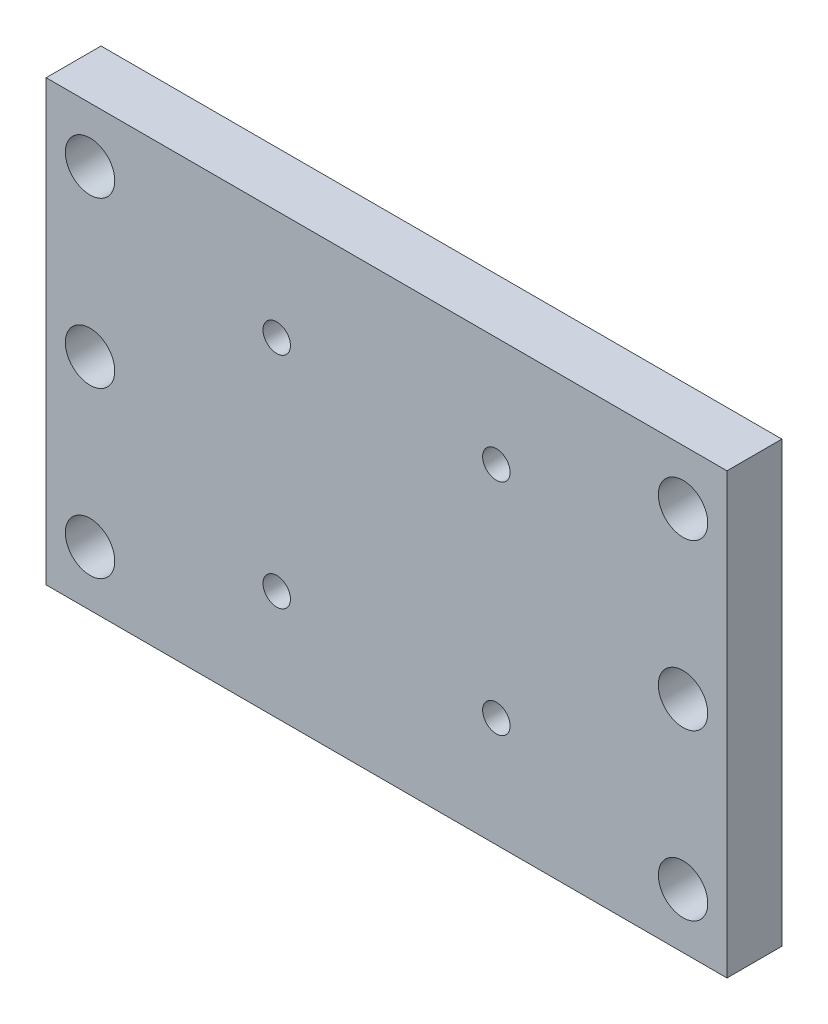
ISO-10303-21;
HEADER;
FILE_DESCRIPTION(('STEP AP214'),'2;1');
FILE_NAME('part.step','',(''),(''),'','','');
FILE_SCHEMA(('AUTOMOTIVE_DESIGN { 1 0 10303 214 1 1 1 1 }'));
ENDSEC;
DATA;
#1=APPLICATION_CONTEXT('core data for automotive mechanical design processes');
#2=APPLICATION_PROTOCOL_DEFINITION('international standard','automotive_design',2000,#1);
#3=PRODUCT_CONTEXT('',#1,'mechanical');
#4=PRODUCT('Part','Part','',(#3));
#5=PRODUCT_RELATED_PRODUCT_CATEGORY('part','',(#4));
#6=PRODUCT_DEFINITION_FORMATION('','',#4);
#7=PRODUCT_DEFINITION_CONTEXT('part definition',#1,'design');
#8=PRODUCT_DEFINITION('design','',#6,#7);
#9=PRODUCT_DEFINITION_SHAPE('','',#8);
#10=(LENGTH_UNIT() NAMED_UNIT(*) SI_UNIT(.MILLI.,.METRE.));
#11=(NAMED_UNIT(*) PLANE_ANGLE_UNIT() SI_UNIT($,.RADIAN.));
#12=(NAMED_UNIT(*) SI_UNIT($,.STERADIAN.) SOLID_ANGLE_UNIT());
#13=UNCERTAINTY_MEASURE_WITH_UNIT(LENGTH_MEASURE(1.E-05),#10,'distance_accuracy_value','');
#14=(GEOMETRIC_REPRESENTATION_CONTEXT(3) GLOBAL_UNCERTAINTY_ASSIGNED_CONTEXT((#13)) GLOBAL_UNIT_ASSIGNED_CONTEXT((#10,
#11,#12)) REPRESENTATION_CONTEXT('',''));
#15=CARTESIAN_POINT('',(0.,0.,0.));
#16=DIRECTION('',(0.,0.,1.));
#17=DIRECTION('',(1.,0.,0.));
#18=AXIS2_PLACEMENT_3D('',#15,#16,#17);
#19=CARTESIAN_POINT('',(0.,0.,5.));
#20=DIRECTION('',(0.,0.,1.));
#21=DIRECTION('',(1.,0.,0.));
#22=AXIS2_PLACEMENT_3D('',#19,#20,#21);
#23=PLANE('',#22);
#24=CARTESIAN_POINT('',(27.,-4.59957173447538,5.));
#25=DIRECTION('',(0.,0.,1.));
#26=DIRECTION('',(-1.,0.,0.));
#27=AXIS2_PLACEMENT_3D('',#24,#25,#26);
#28=CIRCLE('',#27,2.25);
#29=CARTESIAN_POINT('',(24.75,-4.59957173447538,5.));
#30=VERTEX_POINT('',#29);
#31=EDGE_CURVE('E157',#30,#30,#28,.T.);
#32=ORIENTED_EDGE('',*,*,#31,.F.);
#33=EDGE_LOOP('',(#32));
#34=FACE_BOUND('',#33,.T.);
#35=CARTESIAN_POINT('',(10.,-14.5995717344754,5.));
#36=DIRECTION('',(0.,0.,1.));
#37=DIRECTION('',(-1.,0.,0.));
#38=AXIS2_PLACEMENT_3D('',#35,#36,#37);
#39=CIRCLE('',#38,1.25);
#40=CARTESIAN_POINT('',(8.75,-14.5995717344754,5.));
#41=VERTEX_POINT('',#40);
#42=EDGE_CURVE('E145',#41,#41,#39,.T.);
#43=ORIENTED_EDGE('',*,*,#42,.F.);
#44=EDGE_LOOP('',(#43));
#45=FACE_BOUND('',#44,.T.);
#46=CARTESIAN_POINT('',(-10.,-14.5995717344754,5.));
#47=DIRECTION('',(0.,0.,1.));
#48=DIRECTION('',(1.,0.,0.));
#49=AXIS2_PLACEMENT_3D('',#46,#47,#48);
#50=CIRCLE('',#49,1.25);
#51=CARTESIAN_POINT('',(-8.75,-14.5995717344754,5.));
#52=VERTEX_POINT('',#51);
#53=EDGE_CURVE('E133',#52,#52,#50,.T.);
#54=ORIENTED_EDGE('',*,*,#53,.F.);
#55=EDGE_LOOP('',(#54));
#56=FACE_BOUND('',#55,.T.);
#57=CARTESIAN_POINT('',(-27.,-19.5995717344754,5.));
#58=DIRECTION('',(0.,0.,1.));
#59=DIRECTION('',(1.,0.,0.));
#60=AXIS2_PLACEMENT_3D('',#57,#58,#59);
#61=CIRCLE('',#60,2.25);
#62=CARTESIAN_POINT('',(-24.75,-19.5995717344754,5.));
#63=VERTEX_POINT('',#62);
#64=EDGE_CURVE('E121',#63,#63,#61,.T.);
#65=ORIENTED_EDGE('',*,*,#64,.F.);
#66=EDGE_LOOP('',(#65));
#67=FACE_BOUND('',#66,.T.);
#68=CARTESIAN_POINT('',(-27.,10.4004282655246,5.));
#69=DIRECTION('',(0.,0.,1.));
#70=DIRECTION('',(1.,0.,0.));
#71=AXIS2_PLACEMENT_3D('',#68,#69,#70);
#72=CIRCLE('',#71,2.25);
#73=CARTESIAN_POINT('',(-24.75,10.4004282655246,5.));
#74=VERTEX_POINT('',#73);
#75=EDGE_CURVE('E100',#74,#74,#72,.T.);
#76=ORIENTED_EDGE('',*,*,#75,.F.);
#77=EDGE_LOOP('',(#76));
#78=FACE_BOUND('',#77,.T.);
#79=DIRECTION('',(0.,-1.,0.));
#80=VECTOR('',#79,1.);
#81=CARTESIAN_POINT('',(-31.,15.4004282655246,5.));
#82=LINE('',#81,#80);
#83=CARTESIAN_POINT('',(-31.,15.4004282655246,5.));
#84=VERTEX_POINT('',#83);
#85=CARTESIAN_POINT('',(-31.,-24.5995717344754,5.));
#86=VERTEX_POINT('',#85);
#87=EDGE_CURVE('E85',#84,#86,#82,.T.);
#88=ORIENTED_EDGE('',*,*,#87,.T.);
#89=DIRECTION('',(1.,0.,0.));
#90=VECTOR('',#89,1.);
#91=CARTESIAN_POINT('',(-31.,-24.5995717344754,5.));
#92=LINE('',#91,#90);
#93=CARTESIAN_POINT('',(31.,-24.5995717344754,5.));
#94=VERTEX_POINT('',#93);
#95=EDGE_CURVE('E80',#86,#94,#92,.T.);
#96=ORIENTED_EDGE('',*,*,#95,.T.);
#97=DIRECTION('',(0.,1.,0.));
#98=VECTOR('',#97,1.);
#99=CARTESIAN_POINT('',(31.,15.4004282655246,5.));
#100=LINE('',#99,#98);
#101=CARTESIAN_POINT('',(31.,15.4004282655246,5.));
#102=VERTEX_POINT('',#101);
#103=EDGE_CURVE('E83',#94,#102,#100,.T.);
#104=ORIENTED_EDGE('',*,*,#103,.T.);
#105=DIRECTION('',(-1.,0.,0.));
#106=VECTOR('',#105,1.);
#107=CARTESIAN_POINT('',(-31.,15.4004282655246,5.));
#108=LINE('',#107,#106);
#109=EDGE_CURVE('E50',#102,#84,#108,.T.);
#110=ORIENTED_EDGE('',*,*,#109,.T.);
#111=EDGE_LOOP('',(#88,#96,#104,#110));
#112=FACE_BOUND('',#111,.T.);
#113=CARTESIAN_POINT('',(-27.,-4.59957173447538,5.));
#114=DIRECTION('',(0.,0.,1.));
#115=DIRECTION('',(1.,0.,0.));
#116=AXIS2_PLACEMENT_3D('',#113,#114,#115);
#117=CIRCLE('',#116,2.25);
#118=CARTESIAN_POINT('',(-24.75,-4.59957173447538,5.));
#119=VERTEX_POINT('',#118);
#120=EDGE_CURVE('E115',#119,#119,#117,.T.);
#121=ORIENTED_EDGE('',*,*,#120,.F.);
#122=EDGE_LOOP('',(#121));
#123=FACE_BOUND('',#122,.T.);
#124=CARTESIAN_POINT('',(-10.,5.40042826552462,5.));
#125=DIRECTION('',(0.,0.,1.));
#126=DIRECTION('',(1.,0.,0.));
#127=AXIS2_PLACEMENT_3D('',#124,#125,#126);
#128=CIRCLE('',#127,1.25);
#129=CARTESIAN_POINT('',(-8.75,5.40042826552462,5.));
#130=VERTEX_POINT('',#129);
#131=EDGE_CURVE('E127',#130,#130,#128,.T.);
#132=ORIENTED_EDGE('',*,*,#131,.F.);
#133=EDGE_LOOP('',(#132));
#134=FACE_BOUND('',#133,.T.);
#135=CARTESIAN_POINT('',(10.,5.40042826552462,5.));
#136=DIRECTION('',(0.,0.,1.));
#137=DIRECTION('',(-1.,0.,0.));
#138=AXIS2_PLACEMENT_3D('',#135,#136,#137);
#139=CIRCLE('',#138,1.25);
#140=CARTESIAN_POINT('',(8.75,5.40042826552462,5.));
#141=VERTEX_POINT('',#140);
#142=EDGE_CURVE('E139',#141,#141,#139,.T.);
#143=ORIENTED_EDGE('',*,*,#142,.F.);
#144=EDGE_LOOP('',(#143));
#145=FACE_BOUND('',#144,.T.);
#146=CARTESIAN_POINT('',(27.,-19.5995717344754,5.));
#147=DIRECTION('',(0.,0.,1.));
#148=DIRECTION('',(-1.,0.,0.));
#149=AXIS2_PLACEMENT_3D('',#146,#147,#148);
#150=CIRCLE('',#149,2.25);
#151=CARTESIAN_POINT('',(24.75,-19.5995717344754,5.));
#152=VERTEX_POINT('',#151);
#153=EDGE_CURVE('E151',#152,#152,#150,.T.);
#154=ORIENTED_EDGE('',*,*,#153,.F.);
#155=EDGE_LOOP('',(#154));
#156=FACE_BOUND('',#155,.T.);
#157=CARTESIAN_POINT('',(27.,10.4004282655246,5.));
#158=DIRECTION('',(0.,0.,1.));
#159=DIRECTION('',(-1.,0.,0.));
#160=AXIS2_PLACEMENT_3D('',#157,#158,#159);
#161=CIRCLE('',#160,2.25);
#162=CARTESIAN_POINT('',(24.75,10.4004282655246,5.));
#163=VERTEX_POINT('',#162);
#164=EDGE_CURVE('E163',#163,#163,#161,.T.);
#165=ORIENTED_EDGE('',*,*,#164,.F.);
#166=EDGE_LOOP('',(#165));
#167=FACE_BOUND('',#166,.T.);
#168=ADVANCED_FACE('F33',(#34,#45,#56,#67,#78,#112,#123,#134,#145,#156,#167),#23,.T.);
#169=CARTESIAN_POINT('',(0.,0.,0.));
#170=DIRECTION('',(0.,0.,1.));
#171=DIRECTION('',(1.,0.,0.));
#172=AXIS2_PLACEMENT_3D('',#169,#170,#171);
#173=PLANE('',#172);
#174=DIRECTION('',(0.,-1.,0.));
#175=VECTOR('',#174,1.);
#176=CARTESIAN_POINT('',(-31.,15.4004282655246,0.));
#177=LINE('',#176,#175);
#178=CARTESIAN_POINT('',(-31.,15.4004282655246,0.));
#179=VERTEX_POINT('',#178);
#180=CARTESIAN_POINT('',(-31.,-24.5995717344754,0.));
#181=VERTEX_POINT('',#180);
#182=EDGE_CURVE('E97',#179,#181,#177,.T.);
#183=ORIENTED_EDGE('',*,*,#182,.F.);
#184=DIRECTION('',(-1.,0.,0.));
#185=VECTOR('',#184,1.);
#186=CARTESIAN_POINT('',(-31.,15.4004282655246,0.));
#187=LINE('',#186,#185);
#188=CARTESIAN_POINT('',(31.,15.4004282655246,0.));
#189=VERTEX_POINT('',#188);
#190=EDGE_CURVE('E73',#189,#179,#187,.T.);
#191=ORIENTED_EDGE('',*,*,#190,.F.);
#192=DIRECTION('',(0.,1.,0.));
#193=VECTOR('',#192,1.);
#194=CARTESIAN_POINT('',(31.,15.4004282655246,0.));
#195=LINE('',#194,#193);
#196=CARTESIAN_POINT('',(31.,-24.5995717344754,0.));
#197=VERTEX_POINT('',#196);
#198=EDGE_CURVE('E67',#197,#189,#195,.T.);
#199=ORIENTED_EDGE('',*,*,#198,.F.);
#200=DIRECTION('',(1.,0.,0.));
#201=VECTOR('',#200,1.);
#202=CARTESIAN_POINT('',(-31.,-24.5995717344754,0.));
#203=LINE('',#202,#201);
#204=EDGE_CURVE('E89',#181,#197,#203,.T.);
#205=ORIENTED_EDGE('',*,*,#204,.F.);
#206=EDGE_LOOP('',(#183,#191,#199,#205));
#207=FACE_BOUND('',#206,.T.);
#208=CARTESIAN_POINT('',(-27.,10.4004282655246,0.));
#209=DIRECTION('',(0.,0.,1.));
#210=DIRECTION('',(1.,0.,0.));
#211=AXIS2_PLACEMENT_3D('',#208,#209,#210);
#212=CIRCLE('',#211,2.25);
#213=CARTESIAN_POINT('',(-24.75,10.4004282655246,0.));
#214=VERTEX_POINT('',#213);
#215=EDGE_CURVE('E112',#214,#214,#212,.T.);
#216=ORIENTED_EDGE('',*,*,#215,.T.);
#217=EDGE_LOOP('',(#216));
#218=FACE_BOUND('',#217,.T.);
#219=CARTESIAN_POINT('',(-27.,-4.59957173447538,0.));
#220=DIRECTION('',(0.,0.,1.));
#221=DIRECTION('',(1.,0.,0.));
#222=AXIS2_PLACEMENT_3D('',#219,#220,#221);
#223=CIRCLE('',#222,2.25);
#224=CARTESIAN_POINT('',(-24.75,-4.59957173447538,0.));
#225=VERTEX_POINT('',#224);
#226=EDGE_CURVE('E118',#225,#225,#223,.T.);
#227=ORIENTED_EDGE('',*,*,#226,.T.);
#228=EDGE_LOOP('',(#227));
#229=FACE_BOUND('',#228,.T.);
#230=CARTESIAN_POINT('',(-27.,-19.5995717344754,0.));
#231=DIRECTION('',(0.,0.,1.));
#232=DIRECTION('',(1.,0.,0.));
#233=AXIS2_PLACEMENT_3D('',#230,#231,#232);
#234=CIRCLE('',#233,2.25);
#235=CARTESIAN_POINT('',(-24.75,-19.5995717344754,0.));
#236=VERTEX_POINT('',#235);
#237=EDGE_CURVE('E124',#236,#236,#234,.T.);
#238=ORIENTED_EDGE('',*,*,#237,.T.);
#239=EDGE_LOOP('',(#238));
#240=FACE_BOUND('',#239,.T.);
#241=CARTESIAN_POINT('',(-10.,5.40042826552462,0.));
#242=DIRECTION('',(0.,0.,1.));
#243=DIRECTION('',(1.,0.,0.));
#244=AXIS2_PLACEMENT_3D('',#241,#242,#243);
#245=CIRCLE('',#244,1.25);
#246=CARTESIAN_POINT('',(-8.75,5.40042826552462,0.));
#247=VERTEX_POINT('',#246);
#248=EDGE_CURVE('E130',#247,#247,#245,.T.);
#249=ORIENTED_EDGE('',*,*,#248,.T.);
#250=EDGE_LOOP('',(#249));
#251=FACE_BOUND('',#250,.T.);
#252=CARTESIAN_POINT('',(-10.,-14.5995717344754,0.));
#253=DIRECTION('',(0.,0.,1.));
#254=DIRECTION('',(1.,0.,0.));
#255=AXIS2_PLACEMENT_3D('',#252,#253,#254);
#256=CIRCLE('',#255,1.25);
#257=CARTESIAN_POINT('',(-8.75,-14.5995717344754,0.));
#258=VERTEX_POINT('',#257);
#259=EDGE_CURVE('E136',#258,#258,#256,.T.);
#260=ORIENTED_EDGE('',*,*,#259,.T.);
#261=EDGE_LOOP('',(#260));
#262=FACE_BOUND('',#261,.T.);
#263=CARTESIAN_POINT('',(10.,5.40042826552462,0.));
#264=DIRECTION('',(0.,0.,1.));
#265=DIRECTION('',(-1.,0.,0.));
#266=AXIS2_PLACEMENT_3D('',#263,#264,#265);
#267=CIRCLE('',#266,1.25);
#268=CARTESIAN_POINT('',(8.75,5.40042826552462,0.));
#269=VERTEX_POINT('',#268);
#270=EDGE_CURVE('E142',#269,#269,#267,.T.);
#271=ORIENTED_EDGE('',*,*,#270,.T.);
#272=EDGE_LOOP('',(#271));
#273=FACE_BOUND('',#272,.T.);
#274=CARTESIAN_POINT('',(10.,-14.5995717344754,0.));
#275=DIRECTION('',(0.,0.,1.));
#276=DIRECTION('',(-1.,0.,0.));
#277=AXIS2_PLACEMENT_3D('',#274,#275,#276);
#278=CIRCLE('',#277,1.25);
#279=CARTESIAN_POINT('',(8.75,-14.5995717344754,0.));
#280=VERTEX_POINT('',#279);
#281=EDGE_CURVE('E148',#280,#280,#278,.T.);
#282=ORIENTED_EDGE('',*,*,#281,.T.);
#283=EDGE_LOOP('',(#282));
#284=FACE_BOUND('',#283,.T.);
#285=CARTESIAN_POINT('',(27.,-19.5995717344754,0.));
#286=DIRECTION('',(0.,0.,1.));
#287=DIRECTION('',(-1.,0.,0.));
#288=AXIS2_PLACEMENT_3D('',#285,#286,#287);
#289=CIRCLE('',#288,2.25);
#290=CARTESIAN_POINT('',(24.75,-19.5995717344754,0.));
#291=VERTEX_POINT('',#290);
#292=EDGE_CURVE('E154',#291,#291,#289,.T.);
#293=ORIENTED_EDGE('',*,*,#292,.T.);
#294=EDGE_LOOP('',(#293));
#295=FACE_BOUND('',#294,.T.);
#296=CARTESIAN_POINT('',(27.,-4.59957173447538,0.));
#297=DIRECTION('',(0.,0.,1.));
#298=DIRECTION('',(-1.,0.,0.));
#299=AXIS2_PLACEMENT_3D('',#296,#297,#298);
#300=CIRCLE('',#299,2.25);
#301=CARTESIAN_POINT('',(24.75,-4.59957173447538,0.));
#302=VERTEX_POINT('',#301);
#303=EDGE_CURVE('E160',#302,#302,#300,.T.);
#304=ORIENTED_EDGE('',*,*,#303,.T.);
#305=EDGE_LOOP('',(#304));
#306=FACE_BOUND('',#305,.T.);
#307=CARTESIAN_POINT('',(27.,10.4004282655246,0.));
#308=DIRECTION('',(0.,0.,1.));
#309=DIRECTION('',(-1.,0.,0.));
#310=AXIS2_PLACEMENT_3D('',#307,#308,#309);
#311=CIRCLE('',#310,2.25);
#312=CARTESIAN_POINT('',(24.75,10.4004282655246,0.));
#313=VERTEX_POINT('',#312);
#314=EDGE_CURVE('E166',#313,#313,#311,.T.);
#315=ORIENTED_EDGE('',*,*,#314,.T.);
#316=EDGE_LOOP('',(#315));
#317=FACE_BOUND('',#316,.T.);
#318=ADVANCED_FACE('F108',(#207,#218,#229,#240,#251,#262,#273,#284,#295,#306,#317),#173,.F.);
#319=CARTESIAN_POINT('',(-31.,15.4004282655246,5.));
#320=DIRECTION('',(1.,0.,0.));
#321=DIRECTION('',(0.,1.,0.));
#322=AXIS2_PLACEMENT_3D('',#319,#320,#321);
#323=PLANE('',#322);
#324=ORIENTED_EDGE('',*,*,#182,.T.);
#325=DIRECTION('',(0.,0.,-1.));
#326=VECTOR('',#325,1.);
#327=CARTESIAN_POINT('',(-31.,-24.5995717344754,5.));
#328=LINE('',#327,#326);
#329=EDGE_CURVE('E11',#86,#181,#328,.T.);
#330=ORIENTED_EDGE('',*,*,#329,.F.);
#331=ORIENTED_EDGE('',*,*,#87,.F.);
#332=DIRECTION('',(0.,0.,-1.));
#333=VECTOR('',#332,1.);
#334=CARTESIAN_POINT('',(-31.,15.4004282655246,5.));
#335=LINE('',#334,#333);
#336=EDGE_CURVE('E93',#84,#179,#335,.T.);
#337=ORIENTED_EDGE('',*,*,#336,.T.);
#338=EDGE_LOOP('',(#324,#330,#331,#337));
#339=FACE_BOUND('',#338,.T.);
#340=ADVANCED_FACE('F35',(#339),#323,.F.);
#341=CARTESIAN_POINT('',(-31.,-24.5995717344754,5.));
#342=DIRECTION('',(0.,1.,0.));
#343=DIRECTION('',(0.,0.,1.));
#344=AXIS2_PLACEMENT_3D('',#341,#342,#343);
#345=PLANE('',#344);
#346=ORIENTED_EDGE('',*,*,#204,.T.);
#347=DIRECTION('',(0.,0.,-1.));
#348=VECTOR('',#347,1.);
#349=CARTESIAN_POINT('',(31.,-24.5995717344754,5.));
#350=LINE('',#349,#348);
#351=EDGE_CURVE('E42',#94,#197,#350,.T.);
#352=ORIENTED_EDGE('',*,*,#351,.F.);
#353=ORIENTED_EDGE('',*,*,#95,.F.);
#354=ORIENTED_EDGE('',*,*,#329,.T.);
#355=EDGE_LOOP('',(#346,#352,#353,#354));
#356=FACE_BOUND('',#355,.T.);
#357=ADVANCED_FACE('F88',(#356),#345,.F.);
#358=CARTESIAN_POINT('',(31.,15.4004282655246,5.));
#359=DIRECTION('',(-1.,0.,0.));
#360=DIRECTION('',(0.,-1.,0.));
#361=AXIS2_PLACEMENT_3D('',#358,#359,#360);
#362=PLANE('',#361);
#363=ORIENTED_EDGE('',*,*,#198,.T.);
#364=DIRECTION('',(0.,0.,-1.));
#365=VECTOR('',#364,1.);
#366=CARTESIAN_POINT('',(31.,15.4004282655246,5.));
#367=LINE('',#366,#365);
#368=EDGE_CURVE('E90',#102,#189,#367,.T.);
#369=ORIENTED_EDGE('',*,*,#368,.F.);
#370=ORIENTED_EDGE('',*,*,#103,.F.);
#371=ORIENTED_EDGE('',*,*,#351,.T.);
#372=EDGE_LOOP('',(#363,#369,#370,#371));
#373=FACE_BOUND('',#372,.T.);
#374=ADVANCED_FACE('F91',(#373),#362,.F.);
#375=CARTESIAN_POINT('',(-31.,15.4004282655246,5.));
#376=DIRECTION('',(0.,-1.,0.));
#377=DIRECTION('',(1.,0.,0.));
#378=AXIS2_PLACEMENT_3D('',#375,#376,#377);
#379=PLANE('',#378);
#380=ORIENTED_EDGE('',*,*,#190,.T.);
#381=ORIENTED_EDGE('',*,*,#336,.F.);
#382=ORIENTED_EDGE('',*,*,#109,.F.);
#383=ORIENTED_EDGE('',*,*,#368,.T.);
#384=EDGE_LOOP('',(#380,#381,#382,#383));
#385=FACE_BOUND('',#384,.T.);
#386=ADVANCED_FACE('F105',(#385),#379,.F.);
#387=CARTESIAN_POINT('',(-27.,10.4004282655246,5.));
#388=DIRECTION('',(0.,0.,-1.));
#389=DIRECTION('',(-1.,0.,0.));
#390=AXIS2_PLACEMENT_3D('',#387,#388,#389);
#391=CYLINDRICAL_SURFACE('',#390,2.25);
#392=ORIENTED_EDGE('',*,*,#75,.T.);
#393=EDGE_LOOP('',(#392));
#394=FACE_BOUND('',#393,.T.);
#395=ORIENTED_EDGE('',*,*,#215,.F.);
#396=EDGE_LOOP('',(#395));
#397=FACE_BOUND('',#396,.T.);
#398=ADVANCED_FACE('F185',(#394,#397),#391,.F.);
#399=CARTESIAN_POINT('',(-27.,-4.59957173447538,5.));
#400=DIRECTION('',(0.,0.,-1.));
#401=DIRECTION('',(-1.,0.,0.));
#402=AXIS2_PLACEMENT_3D('',#399,#400,#401);
#403=CYLINDRICAL_SURFACE('',#402,2.25);
#404=ORIENTED_EDGE('',*,*,#120,.T.);
#405=EDGE_LOOP('',(#404));
#406=FACE_BOUND('',#405,.T.);
#407=ORIENTED_EDGE('',*,*,#226,.F.);
#408=EDGE_LOOP('',(#407));
#409=FACE_BOUND('',#408,.T.);
#410=ADVANCED_FACE('F231',(#406,#409),#403,.F.);
#411=CARTESIAN_POINT('',(-27.,-19.5995717344754,5.));
#412=DIRECTION('',(0.,0.,-1.));
#413=DIRECTION('',(-1.,0.,0.));
#414=AXIS2_PLACEMENT_3D('',#411,#412,#413);
#415=CYLINDRICAL_SURFACE('',#414,2.25);
#416=ORIENTED_EDGE('',*,*,#64,.T.);
#417=EDGE_LOOP('',(#416));
#418=FACE_BOUND('',#417,.T.);
#419=ORIENTED_EDGE('',*,*,#237,.F.);
#420=EDGE_LOOP('',(#419));
#421=FACE_BOUND('',#420,.T.);
#422=ADVANCED_FACE('F239',(#418,#421),#415,.F.);
#423=CARTESIAN_POINT('',(-10.,5.40042826552462,5.));
#424=DIRECTION('',(0.,0.,-1.));
#425=DIRECTION('',(-1.,0.,0.));
#426=AXIS2_PLACEMENT_3D('',#423,#424,#425);
#427=CYLINDRICAL_SURFACE('',#426,1.25);
#428=ORIENTED_EDGE('',*,*,#131,.T.);
#429=EDGE_LOOP('',(#428));
#430=FACE_BOUND('',#429,.T.);
#431=ORIENTED_EDGE('',*,*,#248,.F.);
#432=EDGE_LOOP('',(#431));
#433=FACE_BOUND('',#432,.T.);
#434=ADVANCED_FACE('F247',(#430,#433),#427,.F.);
#435=CARTESIAN_POINT('',(-10.,-14.5995717344754,5.));
#436=DIRECTION('',(0.,0.,-1.));
#437=DIRECTION('',(-1.,0.,0.));
#438=AXIS2_PLACEMENT_3D('',#435,#436,#437);
#439=CYLINDRICAL_SURFACE('',#438,1.25);
#440=ORIENTED_EDGE('',*,*,#53,.T.);
#441=EDGE_LOOP('',(#440));
#442=FACE_BOUND('',#441,.T.);
#443=ORIENTED_EDGE('',*,*,#259,.F.);
#444=EDGE_LOOP('',(#443));
#445=FACE_BOUND('',#444,.T.);
#446=ADVANCED_FACE('F256',(#442,#445),#439,.F.);
#447=CARTESIAN_POINT('',(10.,5.40042826552462,5.));
#448=DIRECTION('',(0.,0.,-1.));
#449=DIRECTION('',(-1.,0.,0.));
#450=AXIS2_PLACEMENT_3D('',#447,#448,#449);
#451=CYLINDRICAL_SURFACE('',#450,1.25);
#452=ORIENTED_EDGE('',*,*,#142,.T.);
#453=EDGE_LOOP('',(#452));
#454=FACE_BOUND('',#453,.T.);
#455=ORIENTED_EDGE('',*,*,#270,.F.);
#456=EDGE_LOOP('',(#455));
#457=FACE_BOUND('',#456,.T.);
#458=ADVANCED_FACE('F265',(#454,#457),#451,.F.);
#459=CARTESIAN_POINT('',(10.,-14.5995717344754,5.));
#460=DIRECTION('',(0.,0.,-1.));
#461=DIRECTION('',(-1.,0.,0.));
#462=AXIS2_PLACEMENT_3D('',#459,#460,#461);
#463=CYLINDRICAL_SURFACE('',#462,1.25);
#464=ORIENTED_EDGE('',*,*,#42,.T.);
#465=EDGE_LOOP('',(#464));
#466=FACE_BOUND('',#465,.T.);
#467=ORIENTED_EDGE('',*,*,#281,.F.);
#468=EDGE_LOOP('',(#467));
#469=FACE_BOUND('',#468,.T.);
#470=ADVANCED_FACE('F274',(#466,#469),#463,.F.);
#471=CARTESIAN_POINT('',(27.,-19.5995717344754,5.));
#472=DIRECTION('',(0.,0.,-1.));
#473=DIRECTION('',(-1.,0.,0.));
#474=AXIS2_PLACEMENT_3D('',#471,#472,#473);
#475=CYLINDRICAL_SURFACE('',#474,2.25);
#476=ORIENTED_EDGE('',*,*,#153,.T.);
#477=EDGE_LOOP('',(#476));
#478=FACE_BOUND('',#477,.T.);
#479=ORIENTED_EDGE('',*,*,#292,.F.);
#480=EDGE_LOOP('',(#479));
#481=FACE_BOUND('',#480,.T.);
#482=ADVANCED_FACE('F283',(#478,#481),#475,.F.);
#483=CARTESIAN_POINT('',(27.,-4.59957173447538,5.));
#484=DIRECTION('',(0.,0.,-1.));
#485=DIRECTION('',(-1.,0.,0.));
#486=AXIS2_PLACEMENT_3D('',#483,#484,#485);
#487=CYLINDRICAL_SURFACE('',#486,2.25);
#488=ORIENTED_EDGE('',*,*,#31,.T.);
#489=EDGE_LOOP('',(#488));
#490=FACE_BOUND('',#489,.T.);
#491=ORIENTED_EDGE('',*,*,#303,.F.);
#492=EDGE_LOOP('',(#491));
#493=FACE_BOUND('',#492,.T.);
#494=ADVANCED_FACE('F292',(#490,#493),#487,.F.);
#495=CARTESIAN_POINT('',(27.,10.4004282655246,5.));
#496=DIRECTION('',(0.,0.,-1.));
#497=DIRECTION('',(-1.,0.,0.));
#498=AXIS2_PLACEMENT_3D('',#495,#496,#497);
#499=CYLINDRICAL_SURFACE('',#498,2.25);
#500=ORIENTED_EDGE('',*,*,#164,.T.);
#501=EDGE_LOOP('',(#500));
#502=FACE_BOUND('',#501,.T.);
#503=ORIENTED_EDGE('',*,*,#314,.F.);
#504=EDGE_LOOP('',(#503));
#505=FACE_BOUND('',#504,.T.);
#506=ADVANCED_FACE('F172',(#502,#505),#499,.F.);
#507=CLOSED_SHELL('',(#168,#318,#340,#357,#374,#386,#398,#410,#422,#434,#446,#458,#470,#482,
#494,#506));
#508=MANIFOLD_SOLID_BREP('B2',#507);
#509=ADVANCED_BREP_SHAPE_REPRESENTATION('',(#18,#508),#14);
#510=SHAPE_DEFINITION_REPRESENTATION(#9,#509);
ENDSEC;
END-ISO-10303-21;
